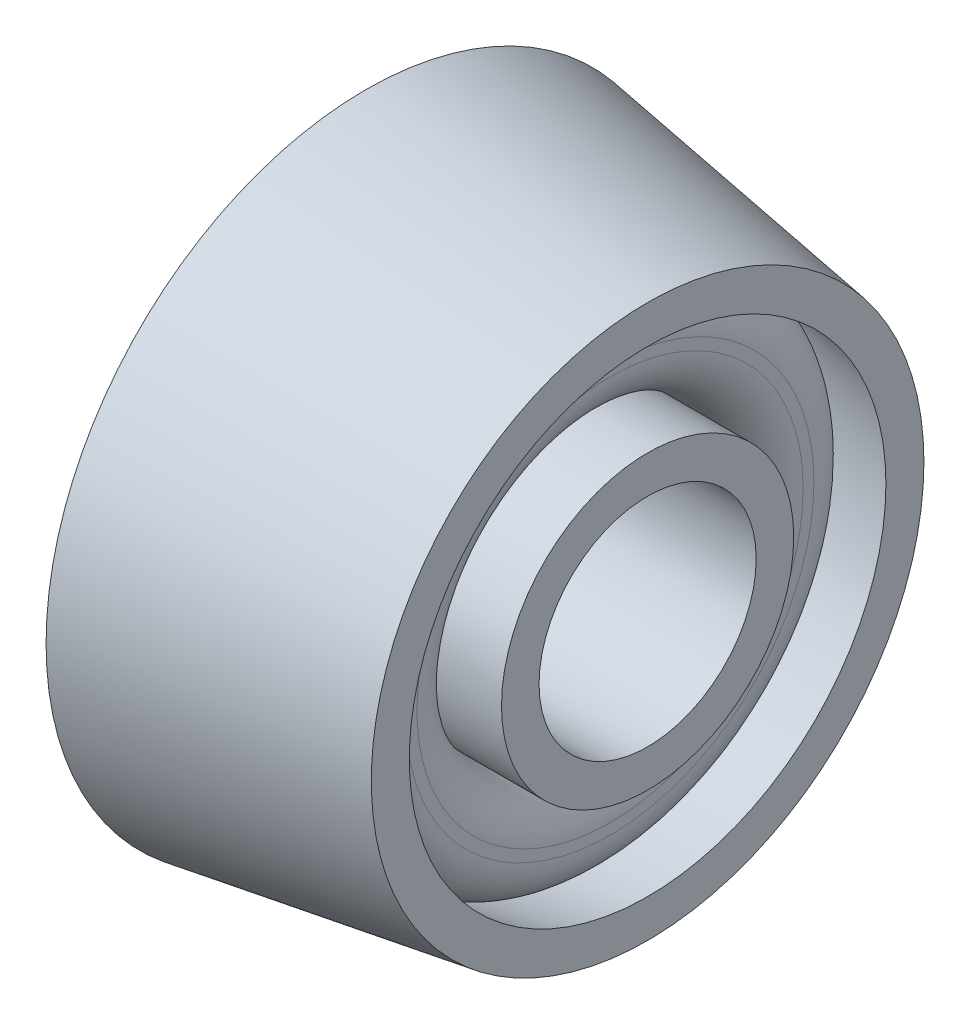
ISO-10303-21;
HEADER;
FILE_DESCRIPTION(('STEP AP214'),'2;1');
FILE_NAME('part.step','',(''),(''),'','','');
FILE_SCHEMA(('AUTOMOTIVE_DESIGN { 1 0 10303 214 1 1 1 1 }'));
ENDSEC;
DATA;
#1=APPLICATION_CONTEXT('core data for automotive mechanical design processes');
#2=APPLICATION_PROTOCOL_DEFINITION('international standard','automotive_design',2000,#1);
#3=PRODUCT_CONTEXT('',#1,'mechanical');
#4=PRODUCT('Part','Part','',(#3));
#5=PRODUCT_RELATED_PRODUCT_CATEGORY('part','',(#4));
#6=PRODUCT_DEFINITION_FORMATION('','',#4);
#7=PRODUCT_DEFINITION_CONTEXT('part definition',#1,'design');
#8=PRODUCT_DEFINITION('design','',#6,#7);
#9=PRODUCT_DEFINITION_SHAPE('','',#8);
#10=(LENGTH_UNIT() NAMED_UNIT(*) SI_UNIT(.MILLI.,.METRE.));
#11=(NAMED_UNIT(*) PLANE_ANGLE_UNIT() SI_UNIT($,.RADIAN.));
#12=(NAMED_UNIT(*) SI_UNIT($,.STERADIAN.) SOLID_ANGLE_UNIT());
#13=UNCERTAINTY_MEASURE_WITH_UNIT(LENGTH_MEASURE(1.E-05),#10,'distance_accuracy_value','');
#14=(GEOMETRIC_REPRESENTATION_CONTEXT(3) GLOBAL_UNCERTAINTY_ASSIGNED_CONTEXT((#13)) GLOBAL_UNIT_ASSIGNED_CONTEXT((#10,
#11,#12)) REPRESENTATION_CONTEXT('',''));
#15=CARTESIAN_POINT('',(0.,0.,0.));
#16=DIRECTION('',(0.,0.,1.));
#17=DIRECTION('',(1.,0.,0.));
#18=AXIS2_PLACEMENT_3D('',#15,#16,#17);
#19=CARTESIAN_POINT('',(901.2130230538,0.,-109.0514268413));
#20=DIRECTION('',(1.,0.,0.));
#21=DIRECTION('',(0.,0.,-1.));
#22=AXIS2_PLACEMENT_3D('',#19,#20,#21);
#23=PLANE('',#22);
#24=CARTESIAN_POINT('',(901.2130230538,0.,-90.3656250687902));
#25=DIRECTION('',(1.,0.,0.));
#26=DIRECTION('',(0.,0.,-1.));
#27=AXIS2_PLACEMENT_3D('',#24,#25,#26);
#28=CIRCLE('',#27,18.6858017725102);
#29=CARTESIAN_POINT('',(901.2130230538,0.,-109.0514268413));
#30=VERTEX_POINT('',#29);
#31=EDGE_CURVE('E10',#30,#30,#28,.T.);
#32=ORIENTED_EDGE('',*,*,#31,.T.);
#33=EDGE_LOOP('',(#32));
#34=FACE_BOUND('',#33,.T.);
#35=CARTESIAN_POINT('',(901.2130230538,0.,-90.3656250687902));
#36=DIRECTION('',(1.,0.,0.));
#37=DIRECTION('',(0.,0.,-1.));
#38=AXIS2_PLACEMENT_3D('',#35,#36,#37);
#39=CIRCLE('',#38,16.1156349476851);
#40=CARTESIAN_POINT('',(901.2130230538,0.,-106.481260016475));
#41=VERTEX_POINT('',#40);
#42=EDGE_CURVE('E37',#41,#41,#39,.T.);
#43=ORIENTED_EDGE('',*,*,#42,.F.);
#44=EDGE_LOOP('',(#43));
#45=FACE_BOUND('',#44,.T.);
#46=ADVANCED_FACE('F33',(#34,#45),#23,.T.);
#47=CARTESIAN_POINT('',(901.2130230538,0.,-90.3656250687902));
#48=DIRECTION('',(-1.,0.,0.));
#49=DIRECTION('',(0.,0.,1.));
#50=AXIS2_PLACEMENT_3D('',#47,#48,#49);
#51=CIRCLE('',#50,7.34186999999999);
#52=CARTESIAN_POINT('',(901.2130230538,0.,-83.0237550687902));
#53=VERTEX_POINT('',#52);
#54=EDGE_CURVE('E46',#53,#53,#51,.T.);
#55=ORIENTED_EDGE('',*,*,#54,.T.);
#56=EDGE_LOOP('',(#55));
#57=FACE_BOUND('',#56,.T.);
#58=CARTESIAN_POINT('',(901.2130230538,0.,-90.3656250687902));
#59=DIRECTION('',(1.,0.,0.));
#60=DIRECTION('',(0.,0.,-1.));
#61=AXIS2_PLACEMENT_3D('',#58,#59,#60);
#62=CIRCLE('',#61,9.88186999999999);
#63=CARTESIAN_POINT('',(901.2130230538,0.,-100.24749506879));
#64=VERTEX_POINT('',#63);
#65=EDGE_CURVE('E49',#64,#64,#62,.F.);
#66=ORIENTED_EDGE('',*,*,#65,.F.);
#67=EDGE_LOOP('',(#66));
#68=FACE_BOUND('',#67,.T.);
#69=ADVANCED_FACE('F70',(#57,#68),#23,.T.);
#70=CARTESIAN_POINT('',(901.2130230538,0.,-90.3656250687902));
#71=DIRECTION('',(-1.,0.,0.));
#72=DIRECTION('',(0.,0.,1.));
#73=AXIS2_PLACEMENT_3D('',#70,#71,#72);
#74=CONICAL_SURFACE('',#73,18.6858017725102,0.153364501021489);
#75=CARTESIAN_POINT('',(882.163023053798,0.,-90.3656250687902));
#76=DIRECTION('',(1.,0.,0.));
#77=DIRECTION('',(0.,0.,-1.));
#78=AXIS2_PLACEMENT_3D('',#75,#76,#77);
#79=CIRCLE('',#78,21.6305190412924);
#80=CARTESIAN_POINT('',(882.163023053798,0.,-111.996144110083));
#81=VERTEX_POINT('',#80);
#82=EDGE_CURVE('E41',#81,#81,#79,.T.);
#83=ORIENTED_EDGE('',*,*,#82,.T.);
#84=EDGE_LOOP('',(#83));
#85=FACE_BOUND('',#84,.T.);
#86=ORIENTED_EDGE('',*,*,#31,.F.);
#87=EDGE_LOOP('',(#86));
#88=FACE_BOUND('',#87,.T.);
#89=ADVANCED_FACE('F35',(#85,#88),#74,.T.);
#90=CARTESIAN_POINT('',(882.163023053799,0.,-111.996144110083));
#91=DIRECTION('',(-1.,0.,0.));
#92=DIRECTION('',(0.,0.,1.));
#93=AXIS2_PLACEMENT_3D('',#90,#91,#92);
#94=PLANE('',#93);
#95=CARTESIAN_POINT('',(882.163023053799,0.,-90.3656250687902));
#96=DIRECTION('',(-1.,0.,0.));
#97=DIRECTION('',(0.,0.,1.));
#98=AXIS2_PLACEMENT_3D('',#95,#96,#97);
#99=CIRCLE('',#98,7.34187);
#100=CARTESIAN_POINT('',(882.163023053799,0.,-83.0237550687902));
#101=VERTEX_POINT('',#100);
#102=EDGE_CURVE('E55',#101,#101,#99,.T.);
#103=ORIENTED_EDGE('',*,*,#102,.F.);
#104=EDGE_LOOP('',(#103));
#105=FACE_BOUND('',#104,.T.);
#106=ORIENTED_EDGE('',*,*,#82,.F.);
#107=EDGE_LOOP('',(#106));
#108=FACE_BOUND('',#107,.T.);
#109=ADVANCED_FACE('F77',(#105,#108),#94,.T.);
#110=CARTESIAN_POINT('',(882.163023053799,0.,-90.3656250687902));
#111=DIRECTION('',(-1.,0.,0.));
#112=DIRECTION('',(0.,0.,1.));
#113=AXIS2_PLACEMENT_3D('',#110,#111,#112);
#114=CYLINDRICAL_SURFACE('',#113,7.34186999999999);
#115=ORIENTED_EDGE('',*,*,#54,.F.);
#116=EDGE_LOOP('',(#115));
#117=FACE_BOUND('',#116,.T.);
#118=ORIENTED_EDGE('',*,*,#102,.T.);
#119=EDGE_LOOP('',(#118));
#120=FACE_BOUND('',#119,.T.);
#121=ADVANCED_FACE('F73',(#117,#120),#114,.F.);
#122=CARTESIAN_POINT('',(928.636701013257,0.,-90.3656250687902));
#123=DIRECTION('',(-1.,0.,0.));
#124=DIRECTION('',(0.,0.,1.));
#125=AXIS2_PLACEMENT_3D('',#122,#123,#124);
#126=CONICAL_SURFACE('',#125,11.8765284878046,0.153364501021493);
#127=ORIENTED_EDGE('',*,*,#42,.T.);
#128=EDGE_LOOP('',(#127));
#129=FACE_BOUND('',#128,.T.);
#130=CARTESIAN_POINT('',(895.983048759166,0.,-90.3656250687902));
#131=DIRECTION('',(1.,0.,0.));
#132=DIRECTION('',(0.,0.,-1.));
#133=AXIS2_PLACEMENT_3D('',#130,#131,#132);
#134=CIRCLE('',#133,16.9240756626823);
#135=CARTESIAN_POINT('',(895.983048759166,0.,-107.289700731472));
#136=VERTEX_POINT('',#135);
#137=EDGE_CURVE('E120',#136,#136,#134,.T.);
#138=ORIENTED_EDGE('',*,*,#137,.F.);
#139=EDGE_LOOP('',(#138));
#140=FACE_BOUND('',#139,.T.);
#141=ADVANCED_FACE('F76',(#129,#140),#126,.F.);
#142=CARTESIAN_POINT('',(1002.11186629569,0.,-90.3656250687902));
#143=DIRECTION('',(1.,0.,0.));
#144=DIRECTION('',(0.,0.,-1.));
#145=AXIS2_PLACEMENT_3D('',#142,#143,#144);
#146=CYLINDRICAL_SURFACE('',#145,9.88186999999999);
#147=ORIENTED_EDGE('',*,*,#65,.T.);
#148=EDGE_LOOP('',(#147));
#149=FACE_BOUND('',#148,.T.);
#150=CARTESIAN_POINT('',(895.4980230538,0.,-90.3656250687902));
#151=DIRECTION('',(1.,0.,0.));
#152=DIRECTION('',(0.,0.,-1.));
#153=AXIS2_PLACEMENT_3D('',#150,#151,#152);
#154=CIRCLE('',#153,9.88186999999999);
#155=CARTESIAN_POINT('',(895.4980230538,0.,-100.24749506879));
#156=VERTEX_POINT('',#155);
#157=EDGE_CURVE('E51',#156,#156,#154,.T.);
#158=ORIENTED_EDGE('',*,*,#157,.T.);
#159=EDGE_LOOP('',(#158));
#160=FACE_BOUND('',#159,.T.);
#161=ADVANCED_FACE('F98',(#149,#160),#146,.T.);
#162=CARTESIAN_POINT('',(895.4980230538,0.,-90.3656250687902));
#163=DIRECTION('',(1.,0.,0.));
#164=DIRECTION('',(0.,0.,-1.));
#165=AXIS2_PLACEMENT_3D('',#162,#163,#164);
#166=TOROIDAL_SURFACE('',#165,13.05687,3.17500000000002);
#167=ORIENTED_EDGE('',*,*,#157,.F.);
#168=EDGE_LOOP('',(#167));
#169=FACE_BOUND('',#168,.T.);
#170=CARTESIAN_POINT('',(898.6730230538,0.,-90.3656250687902));
#171=DIRECTION('',(1.,0.,0.));
#172=DIRECTION('',(0.,0.,-1.));
#173=AXIS2_PLACEMENT_3D('',#170,#171,#172);
#174=CIRCLE('',#173,13.05687);
#175=CARTESIAN_POINT('',(898.6730230538,0.,-103.42249506879));
#176=VERTEX_POINT('',#175);
#177=EDGE_CURVE('E57',#176,#176,#174,.T.);
#178=ORIENTED_EDGE('',*,*,#177,.T.);
#179=EDGE_LOOP('',(#178));
#180=FACE_BOUND('',#179,.T.);
#181=ADVANCED_FACE('F102',(#169,#180),#166,.T.);
#182=CARTESIAN_POINT('',(898.6730230538,0.,-104.151966666078));
#183=DIRECTION('',(-1.,0.,0.));
#184=DIRECTION('',(0.,0.,1.));
#185=AXIS2_PLACEMENT_3D('',#182,#183,#184);
#186=PLANE('',#185);
#187=ORIENTED_EDGE('',*,*,#177,.F.);
#188=EDGE_LOOP('',(#187));
#189=FACE_BOUND('',#188,.T.);
#190=CARTESIAN_POINT('',(898.6730230538,0.,-90.3656250687902));
#191=DIRECTION('',(1.,0.,0.));
#192=DIRECTION('',(0.,0.,-1.));
#193=AXIS2_PLACEMENT_3D('',#190,#191,#192);
#194=CIRCLE('',#193,13.786341597288);
#195=CARTESIAN_POINT('',(898.6730230538,0.,-104.151966666078));
#196=VERTEX_POINT('',#195);
#197=EDGE_CURVE('E62',#196,#196,#194,.T.);
#198=ORIENTED_EDGE('',*,*,#197,.T.);
#199=EDGE_LOOP('',(#198));
#200=FACE_BOUND('',#199,.T.);
#201=ADVANCED_FACE('F105',(#189,#200),#186,.F.);
#202=CARTESIAN_POINT('',(895.4980230538,0.,-90.3656250687902));
#203=DIRECTION('',(1.,0.,0.));
#204=DIRECTION('',(0.,0.,-1.));
#205=AXIS2_PLACEMENT_3D('',#202,#203,#204);
#206=TOROIDAL_SURFACE('',#205,13.786341597288,3.17500000000015);
#207=ORIENTED_EDGE('',*,*,#197,.F.);
#208=EDGE_LOOP('',(#207));
#209=FACE_BOUND('',#208,.T.);
#210=ORIENTED_EDGE('',*,*,#137,.T.);
#211=EDGE_LOOP('',(#210));
#212=FACE_BOUND('',#211,.T.);
#213=ADVANCED_FACE('F109',(#209,#212),#206,.T.);
#214=CLOSED_SHELL('',(#46,#69,#89,#109,#121,#141,#161,#181,#201,#213));
#215=MANIFOLD_SOLID_BREP('B2',#214);
#216=ADVANCED_BREP_SHAPE_REPRESENTATION('',(#18,#215),#14);
#217=SHAPE_DEFINITION_REPRESENTATION(#9,#216);
ENDSEC;
END-ISO-10303-21;
